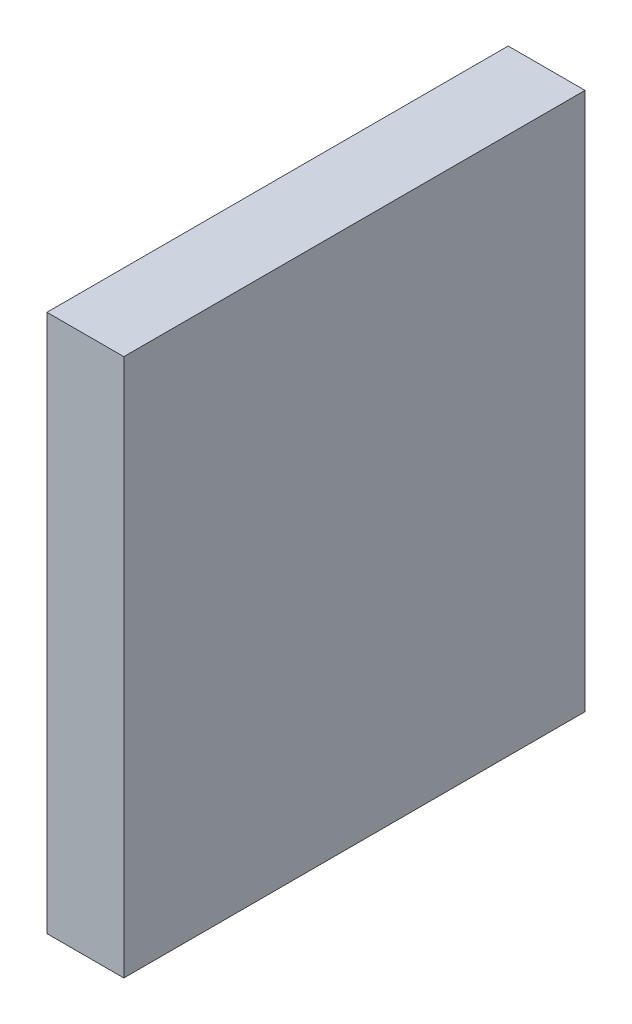
ISO-10303-21;
HEADER;
FILE_DESCRIPTION(('STEP AP214'),'2;1');
FILE_NAME('part.step','',(''),(''),'','','');
FILE_SCHEMA(('AUTOMOTIVE_DESIGN { 1 0 10303 214 1 1 1 1 }'));
ENDSEC;
DATA;
#1=APPLICATION_CONTEXT('core data for automotive mechanical design processes');
#2=APPLICATION_PROTOCOL_DEFINITION('international standard','automotive_design',2000,#1);
#3=PRODUCT_CONTEXT('',#1,'mechanical');
#4=PRODUCT('Part','Part','',(#3));
#5=PRODUCT_RELATED_PRODUCT_CATEGORY('part','',(#4));
#6=PRODUCT_DEFINITION_FORMATION('','',#4);
#7=PRODUCT_DEFINITION_CONTEXT('part definition',#1,'design');
#8=PRODUCT_DEFINITION('design','',#6,#7);
#9=PRODUCT_DEFINITION_SHAPE('','',#8);
#10=(LENGTH_UNIT() NAMED_UNIT(*) SI_UNIT(.MILLI.,.METRE.));
#11=(NAMED_UNIT(*) PLANE_ANGLE_UNIT() SI_UNIT($,.RADIAN.));
#12=(NAMED_UNIT(*) SI_UNIT($,.STERADIAN.) SOLID_ANGLE_UNIT());
#13=UNCERTAINTY_MEASURE_WITH_UNIT(LENGTH_MEASURE(1.E-05),#10,'distance_accuracy_value','');
#14=(GEOMETRIC_REPRESENTATION_CONTEXT(3) GLOBAL_UNCERTAINTY_ASSIGNED_CONTEXT((#13)) GLOBAL_UNIT_ASSIGNED_CONTEXT((#10,
#11,#12)) REPRESENTATION_CONTEXT('',''));
#15=CARTESIAN_POINT('',(0.,0.,0.));
#16=DIRECTION('',(0.,0.,1.));
#17=DIRECTION('',(1.,0.,0.));
#18=AXIS2_PLACEMENT_3D('',#15,#16,#17);
#19=CARTESIAN_POINT('',(24.1,1.87,13.36));
#20=DIRECTION('',(-1.,0.,0.));
#21=DIRECTION('',(0.,0.,1.));
#22=AXIS2_PLACEMENT_3D('',#19,#20,#21);
#23=PLANE('',#22);
#24=DIRECTION('',(0.,0.,1.));
#25=VECTOR('',#24,1.);
#26=CARTESIAN_POINT('',(24.1,2.22,13.66));
#27=LINE('',#26,#25);
#28=CARTESIAN_POINT('',(24.1,2.22,13.66));
#29=VERTEX_POINT('',#28);
#30=CARTESIAN_POINT('',(24.1,2.22,13.06));
#31=VERTEX_POINT('',#30);
#32=EDGE_CURVE('E79',#29,#31,#27,.F.);
#33=ORIENTED_EDGE('',*,*,#32,.F.);
#34=DIRECTION('',(0.,1.,0.));
#35=VECTOR('',#34,1.);
#36=CARTESIAN_POINT('',(24.1,1.52,13.66));
#37=LINE('',#36,#35);
#38=CARTESIAN_POINT('',(24.1,1.52,13.66));
#39=VERTEX_POINT('',#38);
#40=EDGE_CURVE('E55',#39,#29,#37,.T.);
#41=ORIENTED_EDGE('',*,*,#40,.F.);
#42=DIRECTION('',(0.,0.,-1.));
#43=VECTOR('',#42,1.);
#44=CARTESIAN_POINT('',(24.1,1.52,13.06));
#45=LINE('',#44,#43);
#46=CARTESIAN_POINT('',(24.1,1.52,13.06));
#47=VERTEX_POINT('',#46);
#48=EDGE_CURVE('E57',#47,#39,#45,.F.);
#49=ORIENTED_EDGE('',*,*,#48,.F.);
#50=DIRECTION('',(0.,1.,0.));
#51=VECTOR('',#50,1.);
#52=CARTESIAN_POINT('',(24.1,2.22,13.06));
#53=LINE('',#52,#51);
#54=EDGE_CURVE('E20',#31,#47,#53,.F.);
#55=ORIENTED_EDGE('',*,*,#54,.F.);
#56=EDGE_LOOP('',(#33,#41,#49,#55));
#57=FACE_BOUND('',#56,.T.);
#58=ADVANCED_FACE('F17',(#57),#23,.F.);
#59=CARTESIAN_POINT('',(24.1,2.22,13.06));
#60=DIRECTION('',(0.,0.,-1.));
#61=DIRECTION('',(-1.,0.,0.));
#62=AXIS2_PLACEMENT_3D('',#59,#60,#61);
#63=PLANE('',#62);
#64=DIRECTION('',(0.,1.,0.));
#65=VECTOR('',#64,1.);
#66=CARTESIAN_POINT('',(24.,1.87,13.06));
#67=LINE('',#66,#65);
#68=CARTESIAN_POINT('',(24.,2.22,13.06));
#69=VERTEX_POINT('',#68);
#70=CARTESIAN_POINT('',(24.,1.52,13.06));
#71=VERTEX_POINT('',#70);
#72=EDGE_CURVE('E83',#69,#71,#67,.F.);
#73=ORIENTED_EDGE('',*,*,#72,.F.);
#74=DIRECTION('',(1.,0.,0.));
#75=VECTOR('',#74,1.);
#76=CARTESIAN_POINT('',(24.1,2.22,13.06));
#77=LINE('',#76,#75);
#78=EDGE_CURVE('E68',#31,#69,#77,.F.);
#79=ORIENTED_EDGE('',*,*,#78,.F.);
#80=ORIENTED_EDGE('',*,*,#54,.T.);
#81=DIRECTION('',(1.,0.,0.));
#82=VECTOR('',#81,1.);
#83=CARTESIAN_POINT('',(24.1,1.52,13.06));
#84=LINE('',#83,#82);
#85=EDGE_CURVE('E63',#71,#47,#84,.T.);
#86=ORIENTED_EDGE('',*,*,#85,.F.);
#87=EDGE_LOOP('',(#73,#79,#80,#86));
#88=FACE_BOUND('',#87,.T.);
#89=ADVANCED_FACE('F65',(#88),#63,.T.);
#90=CARTESIAN_POINT('',(24.1,1.52,13.06));
#91=DIRECTION('',(0.,-1.,0.));
#92=DIRECTION('',(0.,0.,-1.));
#93=AXIS2_PLACEMENT_3D('',#90,#91,#92);
#94=PLANE('',#93);
#95=DIRECTION('',(0.,0.,1.));
#96=VECTOR('',#95,1.);
#97=CARTESIAN_POINT('',(24.,1.52,13.36));
#98=LINE('',#97,#96);
#99=CARTESIAN_POINT('',(24.,1.52,13.66));
#100=VERTEX_POINT('',#99);
#101=EDGE_CURVE('E72',#71,#100,#98,.T.);
#102=ORIENTED_EDGE('',*,*,#101,.F.);
#103=ORIENTED_EDGE('',*,*,#85,.T.);
#104=ORIENTED_EDGE('',*,*,#48,.T.);
#105=DIRECTION('',(1.,0.,0.));
#106=VECTOR('',#105,1.);
#107=CARTESIAN_POINT('',(24.1,1.52,13.66));
#108=LINE('',#107,#106);
#109=EDGE_CURVE('E75',#100,#39,#108,.T.);
#110=ORIENTED_EDGE('',*,*,#109,.F.);
#111=EDGE_LOOP('',(#102,#103,#104,#110));
#112=FACE_BOUND('',#111,.T.);
#113=ADVANCED_FACE('F70',(#112),#94,.T.);
#114=CARTESIAN_POINT('',(24.1,1.52,13.66));
#115=DIRECTION('',(0.,0.,1.));
#116=DIRECTION('',(1.,0.,0.));
#117=AXIS2_PLACEMENT_3D('',#114,#115,#116);
#118=PLANE('',#117);
#119=DIRECTION('',(0.,1.,0.));
#120=VECTOR('',#119,1.);
#121=CARTESIAN_POINT('',(24.,1.87,13.66));
#122=LINE('',#121,#120);
#123=CARTESIAN_POINT('',(24.,2.22,13.66));
#124=VERTEX_POINT('',#123);
#125=EDGE_CURVE('E26',#100,#124,#122,.T.);
#126=ORIENTED_EDGE('',*,*,#125,.F.);
#127=ORIENTED_EDGE('',*,*,#109,.T.);
#128=ORIENTED_EDGE('',*,*,#40,.T.);
#129=DIRECTION('',(1.,0.,0.));
#130=VECTOR('',#129,1.);
#131=CARTESIAN_POINT('',(24.1,2.22,13.66));
#132=LINE('',#131,#130);
#133=EDGE_CURVE('E35',#124,#29,#132,.T.);
#134=ORIENTED_EDGE('',*,*,#133,.F.);
#135=EDGE_LOOP('',(#126,#127,#128,#134));
#136=FACE_BOUND('',#135,.T.);
#137=ADVANCED_FACE('F89',(#136),#118,.T.);
#138=CARTESIAN_POINT('',(24.1,2.22,13.66));
#139=DIRECTION('',(0.,1.,0.));
#140=DIRECTION('',(0.,0.,1.));
#141=AXIS2_PLACEMENT_3D('',#138,#139,#140);
#142=PLANE('',#141);
#143=DIRECTION('',(0.,0.,1.));
#144=VECTOR('',#143,1.);
#145=CARTESIAN_POINT('',(24.,2.22,13.36));
#146=LINE('',#145,#144);
#147=EDGE_CURVE('E11',#124,#69,#146,.F.);
#148=ORIENTED_EDGE('',*,*,#147,.F.);
#149=ORIENTED_EDGE('',*,*,#133,.T.);
#150=ORIENTED_EDGE('',*,*,#32,.T.);
#151=ORIENTED_EDGE('',*,*,#78,.T.);
#152=EDGE_LOOP('',(#148,#149,#150,#151));
#153=FACE_BOUND('',#152,.T.);
#154=ADVANCED_FACE('F91',(#153),#142,.T.);
#155=CARTESIAN_POINT('',(24.,1.87,13.36));
#156=DIRECTION('',(-1.,0.,0.));
#157=DIRECTION('',(0.,0.,1.));
#158=AXIS2_PLACEMENT_3D('',#155,#156,#157);
#159=PLANE('',#158);
#160=ORIENTED_EDGE('',*,*,#125,.T.);
#161=ORIENTED_EDGE('',*,*,#147,.T.);
#162=ORIENTED_EDGE('',*,*,#72,.T.);
#163=ORIENTED_EDGE('',*,*,#101,.T.);
#164=EDGE_LOOP('',(#160,#161,#162,#163));
#165=FACE_BOUND('',#164,.T.);
#166=ADVANCED_FACE('F88',(#165),#159,.T.);
#167=CLOSED_SHELL('',(#58,#89,#113,#137,#154,#166));
#168=MANIFOLD_SOLID_BREP('B1',#167);
#169=ADVANCED_BREP_SHAPE_REPRESENTATION('',(#18,#168),#14);
#170=SHAPE_DEFINITION_REPRESENTATION(#9,#169);
ENDSEC;
END-ISO-10303-21;
